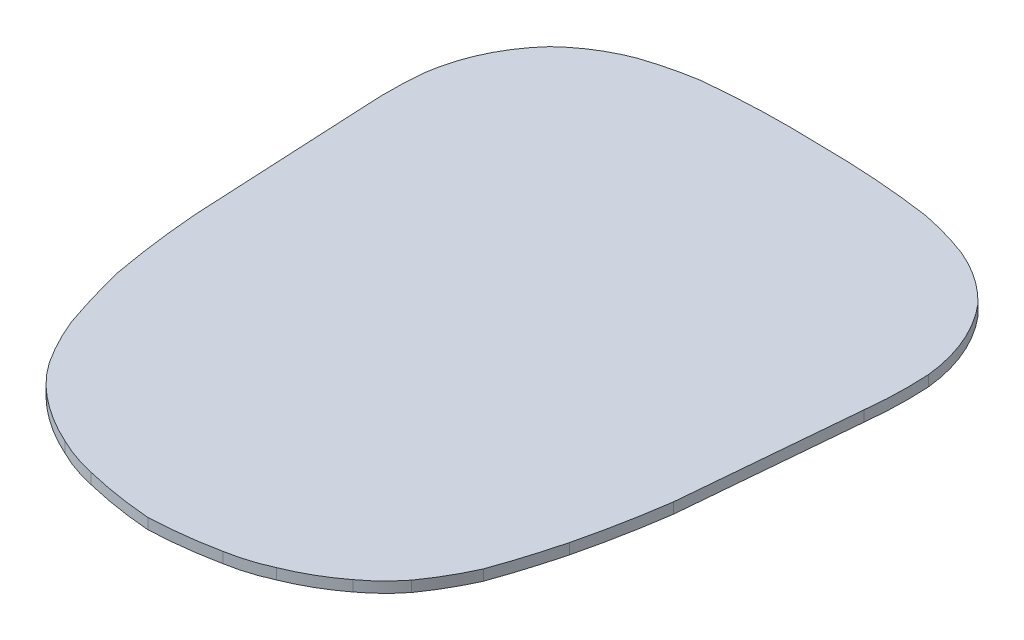
ISO-10303-21;
HEADER;
FILE_DESCRIPTION(('STEP AP214'),'2;1');
FILE_NAME('part.step','',(''),(''),'','','');
FILE_SCHEMA(('AUTOMOTIVE_DESIGN { 1 0 10303 214 1 1 1 1 }'));
ENDSEC;
DATA;
#1=APPLICATION_CONTEXT('core data for automotive mechanical design processes');
#2=APPLICATION_PROTOCOL_DEFINITION('international standard','automotive_design',2000,#1);
#3=PRODUCT_CONTEXT('',#1,'mechanical');
#4=PRODUCT('Part','Part','',(#3));
#5=PRODUCT_RELATED_PRODUCT_CATEGORY('part','',(#4));
#6=PRODUCT_DEFINITION_FORMATION('','',#4);
#7=PRODUCT_DEFINITION_CONTEXT('part definition',#1,'design');
#8=PRODUCT_DEFINITION('design','',#6,#7);
#9=PRODUCT_DEFINITION_SHAPE('','',#8);
#10=(LENGTH_UNIT() NAMED_UNIT(*) SI_UNIT(.MILLI.,.METRE.));
#11=(NAMED_UNIT(*) PLANE_ANGLE_UNIT() SI_UNIT($,.RADIAN.));
#12=(NAMED_UNIT(*) SI_UNIT($,.STERADIAN.) SOLID_ANGLE_UNIT());
#13=UNCERTAINTY_MEASURE_WITH_UNIT(LENGTH_MEASURE(1.E-05),#10,'distance_accuracy_value','');
#14=(GEOMETRIC_REPRESENTATION_CONTEXT(3) GLOBAL_UNCERTAINTY_ASSIGNED_CONTEXT((#13)) GLOBAL_UNIT_ASSIGNED_CONTEXT((#10,
#11,#12)) REPRESENTATION_CONTEXT('',''));
#15=CARTESIAN_POINT('',(0.,0.,0.));
#16=DIRECTION('',(0.,0.,1.));
#17=DIRECTION('',(1.,0.,0.));
#18=AXIS2_PLACEMENT_3D('',#15,#16,#17);
#19=CARTESIAN_POINT('',(-1.57240860866984,5.16860732929248,56.7680888848849));
#20=DIRECTION('',(0.,1.,0.));
#21=DIRECTION('',(1.,0.,0.));
#22=AXIS2_PLACEMENT_3D('',#19,#20,#21);
#23=PLANE('',#22);
#24=CARTESIAN_POINT('',(4.42207857906224,5.16860732929223,26.1060065080088));
#25=DIRECTION('',(0.,-1.,0.));
#26=DIRECTION('',(-1.,0.,0.));
#27=AXIS2_PLACEMENT_3D('',#24,#25,#26);
#28=CIRCLE('',#27,7.3740595978);
#29=CARTESIAN_POINT('',(11.7593440485897,5.16860732929245,25.370282115599));
#30=VERTEX_POINT('',#29);
#31=CARTESIAN_POINT('',(10.0538039694728,5.16860732929234,21.3457098703073));
#32=VERTEX_POINT('',#31);
#33=EDGE_CURVE('E301',#30,#32,#28,.F.);
#34=ORIENTED_EDGE('',*,*,#33,.F.);
#35=CARTESIAN_POINT('',(-5.02148164229063,5.16860732929193,26.3930993028761));
#36=DIRECTION('',(0.,-1.,0.));
#37=DIRECTION('',(-1.,0.,0.));
#38=AXIS2_PLACEMENT_3D('',#35,#36,#37);
#39=CIRCLE('',#38,16.81196793556);
#40=CARTESIAN_POINT('',(11.6806465076376,5.16860732929249,28.3117397407053));
#41=VERTEX_POINT('',#40);
#42=EDGE_CURVE('E304',#41,#30,#39,.F.);
#43=ORIENTED_EDGE('',*,*,#42,.F.);
#44=DIRECTION('',(-0.0886995040357044,0.,0.996058431008854));
#45=VECTOR('',#44,1.);
#46=CARTESIAN_POINT('',(11.6806465076376,5.1686073292925,28.3117397407053));
#47=LINE('',#46,#45);
#48=CARTESIAN_POINT('',(10.9521530708851,5.16860732929253,36.4924171582455));
#49=VERTEX_POINT('',#48);
#50=EDGE_CURVE('E195',#41,#49,#47,.T.);
#51=ORIENTED_EDGE('',*,*,#50,.T.);
#52=CARTESIAN_POINT('',(-29.9774053404907,5.1686073292912,30.7359674961748));
#53=DIRECTION('',(0.,-1.,0.));
#54=DIRECTION('',(-1.,0.,0.));
#55=AXIS2_PLACEMENT_3D('',#52,#53,#54);
#56=CIRCLE('',#55,41.33237791928);
#57=CARTESIAN_POINT('',(10.168074425755,5.16860732929263,40.5698842540155));
#58=VERTEX_POINT('',#57);
#59=EDGE_CURVE('E20',#58,#49,#56,.F.);
#60=ORIENTED_EDGE('',*,*,#59,.F.);
#61=CARTESIAN_POINT('',(-23.6697185475927,5.16860732929142,31.8539569853536));
#62=DIRECTION('',(0.,-1.,0.));
#63=DIRECTION('',(-1.,0.,0.));
#64=AXIS2_PLACEMENT_3D('',#61,#62,#63);
#65=CIRCLE('',#64,34.94228987144);
#66=CARTESIAN_POINT('',(9.22351885768019,5.16860732929264,43.6437218031986));
#67=VERTEX_POINT('',#66);
#68=EDGE_CURVE('E193',#67,#58,#65,.F.);
#69=ORIENTED_EDGE('',*,*,#68,.F.);
#70=CARTESIAN_POINT('',(-2.27662830007267,5.1686073292922,38.4722908655235));
#71=DIRECTION('',(0.,-1.,0.));
#72=DIRECTION('',(-1.,0.,0.));
#73=AXIS2_PLACEMENT_3D('',#70,#71,#72);
#74=CIRCLE('',#73,12.60940452968);
#75=CARTESIAN_POINT('',(8.0018089067518,5.16860732929262,45.7764548271608));
#76=VERTEX_POINT('',#75);
#77=EDGE_CURVE('E206',#76,#67,#74,.F.);
#78=ORIENTED_EDGE('',*,*,#77,.F.);
#79=CARTESIAN_POINT('',(2.40671094314175,5.16860732929238,41.4066557836026));
#80=DIRECTION('',(0.,-1.,0.));
#81=DIRECTION('',(-1.,0.,0.));
#82=AXIS2_PLACEMENT_3D('',#79,#80,#81);
#83=CIRCLE('',#82,7.09931439672);
#84=CARTESIAN_POINT('',(6.60488205735892,5.1686073292926,47.1316557136662));
#85=VERTEX_POINT('',#84);
#86=EDGE_CURVE('E224',#85,#76,#83,.F.);
#87=ORIENTED_EDGE('',*,*,#86,.F.);
#88=CARTESIAN_POINT('',(0.665319016808511,5.1686073292923,39.3768483498174));
#89=DIRECTION('',(0.,-1.,0.));
#90=DIRECTION('',(-1.,0.,0.));
#91=AXIS2_PLACEMENT_3D('',#88,#89,#90);
#92=CIRCLE('',#91,9.76808304444);
#93=CARTESIAN_POINT('',(4.32729672971718,5.16860732929254,48.4325297484331));
#94=VERTEX_POINT('',#93);
#95=EDGE_CURVE('E228',#94,#85,#92,.F.);
#96=ORIENTED_EDGE('',*,*,#95,.F.);
#97=CARTESIAN_POINT('',(1.09627151620222,5.16860732929234,41.3746398254039));
#98=DIRECTION('',(0.,-1.,0.));
#99=DIRECTION('',(-1.,0.,0.));
#100=AXIS2_PLACEMENT_3D('',#97,#98,#99);
#101=CIRCLE('',#100,7.76230211316);
#102=CARTESIAN_POINT('',(2.42169589731142,5.1686073292925,49.0229458016269));
#103=VERTEX_POINT('',#102);
#104=EDGE_CURVE('E232',#103,#94,#101,.F.);
#105=ORIENTED_EDGE('',*,*,#104,.F.);
#106=CARTESIAN_POINT('',(-1.50562705310554,5.16860732929211,29.7823019466603));
#107=DIRECTION('',(0.,-1.,0.));
#108=DIRECTION('',(-1.,0.,0.));
#109=AXIS2_PLACEMENT_3D('',#106,#107,#108);
#110=CIRCLE('',#109,19.6373684976);
#111=CARTESIAN_POINT('',(-0.711226246908728,5.16860732929241,49.4035957080219));
#112=VERTEX_POINT('',#111);
#113=EDGE_CURVE('E236',#112,#103,#110,.F.);
#114=ORIENTED_EDGE('',*,*,#113,.F.);
#115=CARTESIAN_POINT('',(0.780834496719782,5.16860732929217,29.8233057086877));
#116=DIRECTION('',(0.,-1.,0.));
#117=DIRECTION('',(-1.,0.,0.));
#118=AXIS2_PLACEMENT_3D('',#115,#116,#117);
#119=CIRCLE('',#118,19.63705684976);
#120=CARTESIAN_POINT('',(-3.87229574569524,5.16860732929229,48.9011038171652));
#121=VERTEX_POINT('',#120);
#122=EDGE_CURVE('E240',#121,#112,#119,.F.);
#123=ORIENTED_EDGE('',*,*,#122,.F.);
#124=CARTESIAN_POINT('',(-2.25185647870516,5.16860732929224,41.3098252240714));
#125=DIRECTION('',(0.,-1.,0.));
#126=DIRECTION('',(-1.,0.,0.));
#127=AXIS2_PLACEMENT_3D('',#124,#125,#126);
#128=CIRCLE('',#127,7.76230211316);
#129=CARTESIAN_POINT('',(-5.75361833776045,5.16860732929222,48.2373787589373));
#130=VERTEX_POINT('',#129);
#131=EDGE_CURVE('E244',#130,#121,#128,.F.);
#132=ORIENTED_EDGE('',*,*,#131,.F.);
#133=CARTESIAN_POINT('',(-1.74390750050734,5.16860732929222,39.3302094350337));
#134=DIRECTION('',(0.,-1.,0.));
#135=DIRECTION('',(-1.,0.,0.));
#136=AXIS2_PLACEMENT_3D('',#133,#134,#135);
#137=CIRCLE('',#136,9.76808304444);
#138=CARTESIAN_POINT('',(-7.97915028682781,5.16860732929213,46.8493313092098));
#139=VERTEX_POINT('',#138);
#140=EDGE_CURVE('E248',#139,#130,#137,.F.);
#141=ORIENTED_EDGE('',*,*,#140,.F.);
#142=CARTESIAN_POINT('',(-3.45763258069554,5.1686073292922,41.3761108188031));
#143=DIRECTION('',(0.,-1.,0.));
#144=DIRECTION('',(-1.,0.,0.));
#145=AXIS2_PLACEMENT_3D('',#142,#143,#144);
#146=CIRCLE('',#145,7.09931439672);
#147=CARTESIAN_POINT('',(-9.27735431255502,5.16860732929207,45.4419568398912));
#148=VERTEX_POINT('',#147);
#149=EDGE_CURVE('E252',#148,#139,#146,.F.);
#150=ORIENTED_EDGE('',*,*,#149,.F.);
#151=CARTESIAN_POINT('',(1.27607088396148,5.16860732929231,38.5410656500053));
#152=DIRECTION('',(0.,-1.,0.));
#153=DIRECTION('',(-1.,0.,0.));
#154=AXIS2_PLACEMENT_3D('',#151,#152,#153);
#155=CIRCLE('',#154,12.60940452968);
#156=CARTESIAN_POINT('',(-10.4156070143636,5.168607329292,43.2635385736895));
#157=VERTEX_POINT('',#156);
#158=EDGE_CURVE('E256',#157,#148,#155,.F.);
#159=ORIENTED_EDGE('',*,*,#158,.F.);
#160=CARTESIAN_POINT('',(22.611452308667,5.1686073292929,31.8540261418302));
#161=DIRECTION('',(0.,-1.,0.));
#162=DIRECTION('',(-1.,0.,0.));
#163=AXIS2_PLACEMENT_3D('',#160,#161,#162);
#164=CIRCLE('',#163,34.94228987144);
#165=CARTESIAN_POINT('',(-11.3308378537233,5.16860732929195,40.1536984240254));
#166=VERTEX_POINT('',#165);
#167=EDGE_CURVE('E260',#166,#157,#164,.F.);
#168=ORIENTED_EDGE('',*,*,#167,.F.);
#169=CARTESIAN_POINT('',(29.3351155793447,5.16860732929312,32.7614257124887));
#170=DIRECTION('',(0.,-1.,0.));
#171=DIRECTION('',(-1.,0.,0.));
#172=AXIS2_PLACEMENT_3D('',#169,#170,#171);
#173=CIRCLE('',#172,41.33237791928);
#174=CARTESIAN_POINT('',(-11.8661733347099,5.16860732929185,36.0506895028805));
#175=VERTEX_POINT('',#174);
#176=EDGE_CURVE('E264',#175,#166,#173,.F.);
#177=ORIENTED_EDGE('',*,*,#176,.F.);
#178=DIRECTION('',(-0.0500831809567766,0.,-0.998745050042928));
#179=VECTOR('',#178,1.);
#180=CARTESIAN_POINT('',(-11.86617333471,5.16860732929186,36.0506895028802));
#181=LINE('',#180,#179);
#182=CARTESIAN_POINT('',(-12.2775089900256,5.16860732929179,27.8479467496356));
#183=VERTEX_POINT('',#182);
#184=EDGE_CURVE('E271',#175,#183,#181,.T.);
#185=ORIENTED_EDGE('',*,*,#184,.T.);
#186=CARTESIAN_POINT('',(4.48636162568613,5.16860732929224,26.5771565049552));
#187=DIRECTION('',(0.,-1.,0.));
#188=DIRECTION('',(-1.,0.,0.));
#189=AXIS2_PLACEMENT_3D('',#186,#187,#188);
#190=CIRCLE('',#189,16.81196793556);
#191=CARTESIAN_POINT('',(-12.2423060527562,5.16860732929168,24.9056471359907));
#192=VERTEX_POINT('',#191);
#193=EDGE_CURVE('E267',#192,#183,#190,.F.);
#194=ORIENTED_EDGE('',*,*,#193,.F.);
#195=CARTESIAN_POINT('',(-4.93901211459909,5.16860732929193,25.9247902097461));
#196=DIRECTION('',(0.,-1.,0.));
#197=DIRECTION('',(-1.,0.,0.));
#198=AXIS2_PLACEMENT_3D('',#195,#196,#197);
#199=CIRCLE('',#198,7.3740595978);
#200=CARTESIAN_POINT('',(-10.3822831278823,5.16860732929168,20.9500986989229));
#201=VERTEX_POINT('',#200);
#202=EDGE_CURVE('E273',#201,#192,#199,.F.);
#203=ORIENTED_EDGE('',*,*,#202,.F.);
#204=CARTESIAN_POINT('',(-5.24273193998357,5.16860732929193,26.3246247690594));
#205=DIRECTION('',(0.,-1.,0.));
#206=DIRECTION('',(-1.,0.,0.));
#207=AXIS2_PLACEMENT_3D('',#204,#205,#206);
#208=CIRCLE('',#207,7.43643173112);
#209=CARTESIAN_POINT('',(-7.86404338634427,5.16860732929174,19.3655125273445));
#210=VERTEX_POINT('',#209);
#211=EDGE_CURVE('E277',#210,#201,#208,.F.);
#212=ORIENTED_EDGE('',*,*,#211,.F.);
#213=CARTESIAN_POINT('',(-3.13266364538476,5.1686073292921,33.5130256945662));
#214=DIRECTION('',(0.,-1.,0.));
#215=DIRECTION('',(-1.,0.,0.));
#216=AXIS2_PLACEMENT_3D('',#213,#214,#215);
#217=CIRCLE('',#216,14.91771038296);
#218=CARTESIAN_POINT('',(-5.49599442515238,5.16860732929181,18.7837096651208));
#219=VERTEX_POINT('',#218);
#220=EDGE_CURVE('E281',#219,#210,#217,.F.);
#221=ORIENTED_EDGE('',*,*,#220,.F.);
#222=CARTESIAN_POINT('',(-1.57240860866984,5.16860732929248,56.7680888848849));
#223=DIRECTION('',(0.,-1.,0.));
#224=DIRECTION('',(-1.,0.,0.));
#225=AXIS2_PLACEMENT_3D('',#222,#223,#224);
#226=CIRCLE('',#225,38.18648439396);
#227=CARTESIAN_POINT('',(-0.115098477137755,5.16860732929197,18.6094222736066));
#228=VERTEX_POINT('',#227);
#229=EDGE_CURVE('E285',#228,#219,#226,.F.);
#230=ORIENTED_EDGE('',*,*,#229,.F.);
#231=CARTESIAN_POINT('',(-0.135712780641728,5.16860732929252,56.7959011448422));
#232=DIRECTION('',(0.,-1.,0.));
#233=DIRECTION('',(-1.,0.,0.));
#234=AXIS2_PLACEMENT_3D('',#231,#232,#233);
#235=CIRCLE('',#234,38.186484435371);
#236=CARTESIAN_POINT('',(5.25502065738692,5.16860732929216,18.9918327588477));
#237=VERTEX_POINT('',#236);
#238=EDGE_CURVE('E289',#237,#228,#235,.F.);
#239=ORIENTED_EDGE('',*,*,#238,.F.);
#240=CARTESIAN_POINT('',(2.32340041465548,5.16860732929227,33.6186466915632));
#241=DIRECTION('',(0.,-1.,0.));
#242=DIRECTION('',(-1.,0.,0.));
#243=AXIS2_PLACEMENT_3D('',#240,#241,#242);
#244=CIRCLE('',#243,14.91771038296);
#245=CARTESIAN_POINT('',(7.59877825453698,5.16860732929224,19.6648489391103));
#246=VERTEX_POINT('',#245);
#247=EDGE_CURVE('E293',#246,#237,#244,.F.);
#248=ORIENTED_EDGE('',*,*,#247,.F.);
#249=CARTESIAN_POINT('',(4.71009628830575,5.16860732929225,26.5172961946226));
#250=DIRECTION('',(0.,-1.,0.));
#251=DIRECTION('',(-1.,0.,0.));
#252=AXIS2_PLACEMENT_3D('',#249,#250,#251);
#253=CIRCLE('',#252,7.43643173111999);
#254=EDGE_CURVE('E297',#32,#246,#253,.F.);
#255=ORIENTED_EDGE('',*,*,#254,.F.);
#256=EDGE_LOOP('',(#34,#43,#51,#60,#69,#78,#87,#96,#105,#114,#123,#132,#141,#150,#159,#168,#177,
#185,#194,#203,#212,#221,#230,#239,#248,#255));
#257=FACE_BOUND('',#256,.T.);
#258=ADVANCED_FACE('F17',(#257),#23,.F.);
#259=CARTESIAN_POINT('',(-29.9774053404908,5.5496073292912,30.7359674961748));
#260=DIRECTION('',(0.,-1.,0.));
#261=DIRECTION('',(-1.,0.,0.));
#262=AXIS2_PLACEMENT_3D('',#259,#260,#261);
#263=CYLINDRICAL_SURFACE('',#262,41.33237791928);
#264=DIRECTION('',(0.,-1.,0.));
#265=VECTOR('',#264,1.);
#266=CARTESIAN_POINT('',(10.1680744257548,5.54960732929262,40.5698842540161));
#267=LINE('',#266,#265);
#268=CARTESIAN_POINT('',(10.1680744257549,5.66960732929264,40.5698842540157));
#269=VERTEX_POINT('',#268);
#270=EDGE_CURVE('E200',#58,#269,#267,.F.);
#271=ORIENTED_EDGE('',*,*,#270,.F.);
#272=ORIENTED_EDGE('',*,*,#59,.T.);
#273=DIRECTION('',(0.,1.,0.));
#274=VECTOR('',#273,1.);
#275=CARTESIAN_POINT('',(10.9521530708851,5.54960732929249,36.4924171582454));
#276=LINE('',#275,#274);
#277=CARTESIAN_POINT('',(10.9521530708851,5.66960732929259,36.4924171582455));
#278=VERTEX_POINT('',#277);
#279=EDGE_CURVE('E313',#49,#278,#276,.T.);
#280=ORIENTED_EDGE('',*,*,#279,.T.);
#281=CARTESIAN_POINT('',(-29.9774053404908,5.6696073292912,30.7359674961748));
#282=DIRECTION('',(0.,-1.,0.));
#283=DIRECTION('',(-1.,0.,0.));
#284=AXIS2_PLACEMENT_3D('',#281,#282,#283);
#285=CIRCLE('',#284,41.33237791928);
#286=EDGE_CURVE('E203',#269,#278,#285,.F.);
#287=ORIENTED_EDGE('',*,*,#286,.F.);
#288=EDGE_LOOP('',(#271,#272,#280,#287));
#289=FACE_BOUND('',#288,.T.);
#290=ADVANCED_FACE('F201',(#289),#263,.T.);
#291=CARTESIAN_POINT('',(11.6806465076376,5.54960732929249,28.3117397407053));
#292=DIRECTION('',(-0.996058431008854,0.,-0.0886995040357044));
#293=DIRECTION('',(-0.0886995040357044,0.,0.996058431008854));
#294=AXIS2_PLACEMENT_3D('',#291,#292,#293);
#295=PLANE('',#294);
#296=ORIENTED_EDGE('',*,*,#50,.F.);
#297=DIRECTION('',(0.,-1.,0.));
#298=VECTOR('',#297,1.);
#299=CARTESIAN_POINT('',(11.6806465076376,5.54960732929249,28.3117397407052));
#300=LINE('',#299,#298);
#301=CARTESIAN_POINT('',(11.6806465076376,5.6696073292925,28.3117397407053));
#302=VERTEX_POINT('',#301);
#303=EDGE_CURVE('E306',#302,#41,#300,.T.);
#304=ORIENTED_EDGE('',*,*,#303,.F.);
#305=DIRECTION('',(0.088699504035705,0.,-0.996058431008854));
#306=VECTOR('',#305,1.);
#307=CARTESIAN_POINT('',(10.9521530708851,5.6696073292926,36.4924171582454));
#308=LINE('',#307,#306);
#309=EDGE_CURVE('E215',#278,#302,#308,.T.);
#310=ORIENTED_EDGE('',*,*,#309,.F.);
#311=ORIENTED_EDGE('',*,*,#279,.F.);
#312=EDGE_LOOP('',(#296,#304,#310,#311));
#313=FACE_BOUND('',#312,.T.);
#314=ADVANCED_FACE('F583',(#313),#295,.F.);
#315=CARTESIAN_POINT('',(-5.02148164229064,5.54960732929193,26.3930993028761));
#316=DIRECTION('',(0.,-1.,0.));
#317=DIRECTION('',(-1.,0.,0.));
#318=AXIS2_PLACEMENT_3D('',#315,#316,#317);
#319=CYLINDRICAL_SURFACE('',#318,16.81196793556);
#320=ORIENTED_EDGE('',*,*,#303,.T.);
#321=ORIENTED_EDGE('',*,*,#42,.T.);
#322=DIRECTION('',(0.,-1.,0.));
#323=VECTOR('',#322,1.);
#324=CARTESIAN_POINT('',(11.7593440485897,5.54960732929245,25.3702821155991));
#325=LINE('',#324,#323);
#326=CARTESIAN_POINT('',(11.7593440485897,5.66960732929246,25.3702821155991));
#327=VERTEX_POINT('',#326);
#328=EDGE_CURVE('E303',#327,#30,#325,.T.);
#329=ORIENTED_EDGE('',*,*,#328,.F.);
#330=CARTESIAN_POINT('',(-5.02148164229065,5.66960732929193,26.3930993028761));
#331=DIRECTION('',(0.,-1.,0.));
#332=DIRECTION('',(-1.,0.,0.));
#333=AXIS2_PLACEMENT_3D('',#330,#331,#332);
#334=CIRCLE('',#333,16.81196793556);
#335=EDGE_CURVE('E407',#302,#327,#334,.F.);
#336=ORIENTED_EDGE('',*,*,#335,.F.);
#337=EDGE_LOOP('',(#320,#321,#329,#336));
#338=FACE_BOUND('',#337,.T.);
#339=ADVANCED_FACE('F580',(#338),#319,.T.);
#340=CARTESIAN_POINT('',(4.42207857906223,5.54960732929223,26.1060065080088));
#341=DIRECTION('',(0.,-1.,0.));
#342=DIRECTION('',(-1.,0.,0.));
#343=AXIS2_PLACEMENT_3D('',#340,#341,#342);
#344=CYLINDRICAL_SURFACE('',#343,7.3740595978);
#345=ORIENTED_EDGE('',*,*,#328,.T.);
#346=ORIENTED_EDGE('',*,*,#33,.T.);
#347=DIRECTION('',(0.,-1.,0.));
#348=VECTOR('',#347,1.);
#349=CARTESIAN_POINT('',(10.0538039694727,5.54960732929234,21.3457098703073));
#350=LINE('',#349,#348);
#351=CARTESIAN_POINT('',(10.0538039694727,5.66960732929234,21.3457098703073));
#352=VERTEX_POINT('',#351);
#353=EDGE_CURVE('E300',#352,#32,#350,.T.);
#354=ORIENTED_EDGE('',*,*,#353,.F.);
#355=CARTESIAN_POINT('',(4.42207857906222,5.66960732929223,26.1060065080088));
#356=DIRECTION('',(0.,-1.,0.));
#357=DIRECTION('',(-1.,0.,0.));
#358=AXIS2_PLACEMENT_3D('',#355,#356,#357);
#359=CIRCLE('',#358,7.3740595978);
#360=EDGE_CURVE('E404',#327,#352,#359,.F.);
#361=ORIENTED_EDGE('',*,*,#360,.F.);
#362=EDGE_LOOP('',(#345,#346,#354,#361));
#363=FACE_BOUND('',#362,.T.);
#364=ADVANCED_FACE('F484',(#363),#344,.T.);
#365=CARTESIAN_POINT('',(4.71009628830574,5.54960732929224,26.5172961946226));
#366=DIRECTION('',(0.,-1.,0.));
#367=DIRECTION('',(-1.,0.,0.));
#368=AXIS2_PLACEMENT_3D('',#365,#366,#367);
#369=CYLINDRICAL_SURFACE('',#368,7.43643173111999);
#370=ORIENTED_EDGE('',*,*,#353,.T.);
#371=ORIENTED_EDGE('',*,*,#254,.T.);
#372=DIRECTION('',(0.,-1.,0.));
#373=VECTOR('',#372,1.);
#374=CARTESIAN_POINT('',(7.598778254537,5.54960732929224,19.6648489391103));
#375=LINE('',#374,#373);
#376=CARTESIAN_POINT('',(7.59877825453697,5.66960732929225,19.6648489391103));
#377=VERTEX_POINT('',#376);
#378=EDGE_CURVE('E296',#377,#246,#375,.T.);
#379=ORIENTED_EDGE('',*,*,#378,.F.);
#380=CARTESIAN_POINT('',(4.71009628830574,5.66960732929225,26.5172961946226));
#381=DIRECTION('',(0.,-1.,0.));
#382=DIRECTION('',(-1.,0.,0.));
#383=AXIS2_PLACEMENT_3D('',#380,#381,#382);
#384=CIRCLE('',#383,7.43643173111999);
#385=EDGE_CURVE('E400',#352,#377,#384,.F.);
#386=ORIENTED_EDGE('',*,*,#385,.F.);
#387=EDGE_LOOP('',(#370,#371,#379,#386));
#388=FACE_BOUND('',#387,.T.);
#389=ADVANCED_FACE('F479',(#388),#369,.T.);
#390=CARTESIAN_POINT('',(2.32340041465546,5.54960732929227,33.6186466915632));
#391=DIRECTION('',(0.,-1.,0.));
#392=DIRECTION('',(-1.,0.,0.));
#393=AXIS2_PLACEMENT_3D('',#390,#391,#392);
#394=CYLINDRICAL_SURFACE('',#393,14.91771038296);
#395=ORIENTED_EDGE('',*,*,#378,.T.);
#396=ORIENTED_EDGE('',*,*,#247,.T.);
#397=DIRECTION('',(0.,-1.,0.));
#398=VECTOR('',#397,1.);
#399=CARTESIAN_POINT('',(5.25502065738693,5.54960732929216,18.9918327588477));
#400=LINE('',#399,#398);
#401=CARTESIAN_POINT('',(5.25502065738692,5.66960732929216,18.9918327588477));
#402=VERTEX_POINT('',#401);
#403=EDGE_CURVE('E292',#402,#237,#400,.T.);
#404=ORIENTED_EDGE('',*,*,#403,.F.);
#405=CARTESIAN_POINT('',(2.32340041465546,5.66960732929227,33.6186466915632));
#406=DIRECTION('',(0.,-1.,0.));
#407=DIRECTION('',(-1.,0.,0.));
#408=AXIS2_PLACEMENT_3D('',#405,#406,#407);
#409=CIRCLE('',#408,14.91771038296);
#410=EDGE_CURVE('E396',#377,#402,#409,.F.);
#411=ORIENTED_EDGE('',*,*,#410,.F.);
#412=EDGE_LOOP('',(#395,#396,#404,#411));
#413=FACE_BOUND('',#412,.T.);
#414=ADVANCED_FACE('F489',(#413),#394,.T.);
#415=CARTESIAN_POINT('',(-0.13571278064174,5.54960732929253,56.7959011448422));
#416=DIRECTION('',(0.,-1.,0.));
#417=DIRECTION('',(-1.,0.,0.));
#418=AXIS2_PLACEMENT_3D('',#415,#416,#417);
#419=CYLINDRICAL_SURFACE('',#418,38.186484435371);
#420=ORIENTED_EDGE('',*,*,#403,.T.);
#421=ORIENTED_EDGE('',*,*,#238,.T.);
#422=DIRECTION('',(0.,-1.,0.));
#423=VECTOR('',#422,1.);
#424=CARTESIAN_POINT('',(-0.115098477137782,5.54960732929198,18.6094222736066));
#425=LINE('',#424,#423);
#426=CARTESIAN_POINT('',(-0.115098477137771,5.66960732929198,18.6094222736066));
#427=VERTEX_POINT('',#426);
#428=EDGE_CURVE('E288',#427,#228,#425,.T.);
#429=ORIENTED_EDGE('',*,*,#428,.F.);
#430=CARTESIAN_POINT('',(-0.135712780641744,5.66960732929253,56.7959011448422));
#431=DIRECTION('',(0.,-1.,0.));
#432=DIRECTION('',(-1.,0.,0.));
#433=AXIS2_PLACEMENT_3D('',#430,#431,#432);
#434=CIRCLE('',#433,38.186484435371);
#435=EDGE_CURVE('E392',#402,#427,#434,.F.);
#436=ORIENTED_EDGE('',*,*,#435,.F.);
#437=EDGE_LOOP('',(#420,#421,#429,#436));
#438=FACE_BOUND('',#437,.T.);
#439=ADVANCED_FACE('F569',(#438),#419,.T.);
#440=CARTESIAN_POINT('',(-1.57240860866986,5.54960732929248,56.7680888848849));
#441=DIRECTION('',(0.,-1.,0.));
#442=DIRECTION('',(-1.,0.,0.));
#443=AXIS2_PLACEMENT_3D('',#440,#441,#442);
#444=CYLINDRICAL_SURFACE('',#443,38.18648439396);
#445=ORIENTED_EDGE('',*,*,#428,.T.);
#446=ORIENTED_EDGE('',*,*,#229,.T.);
#447=DIRECTION('',(0.,-1.,0.));
#448=VECTOR('',#447,1.);
#449=CARTESIAN_POINT('',(-5.4959944251524,5.54960732929181,18.7837096651208));
#450=LINE('',#449,#448);
#451=CARTESIAN_POINT('',(-5.49599442515242,5.66960732929181,18.7837096651208));
#452=VERTEX_POINT('',#451);
#453=EDGE_CURVE('E284',#452,#219,#450,.T.);
#454=ORIENTED_EDGE('',*,*,#453,.F.);
#455=CARTESIAN_POINT('',(-1.57240860866986,5.66960732929248,56.7680888848849));
#456=DIRECTION('',(0.,-1.,0.));
#457=DIRECTION('',(-1.,0.,0.));
#458=AXIS2_PLACEMENT_3D('',#455,#456,#457);
#459=CIRCLE('',#458,38.18648439396);
#460=EDGE_CURVE('E388',#427,#452,#459,.F.);
#461=ORIENTED_EDGE('',*,*,#460,.F.);
#462=EDGE_LOOP('',(#445,#446,#454,#461));
#463=FACE_BOUND('',#462,.T.);
#464=ADVANCED_FACE('F565',(#463),#444,.T.);
#465=CARTESIAN_POINT('',(-3.13266364538477,5.5496073292921,33.5130256945662));
#466=DIRECTION('',(0.,-1.,0.));
#467=DIRECTION('',(-1.,0.,0.));
#468=AXIS2_PLACEMENT_3D('',#465,#466,#467);
#469=CYLINDRICAL_SURFACE('',#468,14.91771038296);
#470=ORIENTED_EDGE('',*,*,#453,.T.);
#471=ORIENTED_EDGE('',*,*,#220,.T.);
#472=DIRECTION('',(0.,-1.,0.));
#473=VECTOR('',#472,1.);
#474=CARTESIAN_POINT('',(-7.86404338634426,5.54960732929175,19.3655125273444));
#475=LINE('',#474,#473);
#476=CARTESIAN_POINT('',(-7.86404338634429,5.66960732929175,19.3655125273444));
#477=VERTEX_POINT('',#476);
#478=EDGE_CURVE('E280',#477,#210,#475,.T.);
#479=ORIENTED_EDGE('',*,*,#478,.F.);
#480=CARTESIAN_POINT('',(-3.13266364538477,5.66960732929209,33.5130256945662));
#481=DIRECTION('',(0.,-1.,0.));
#482=DIRECTION('',(-1.,0.,0.));
#483=AXIS2_PLACEMENT_3D('',#480,#481,#482);
#484=CIRCLE('',#483,14.91771038296);
#485=EDGE_CURVE('E384',#452,#477,#484,.F.);
#486=ORIENTED_EDGE('',*,*,#485,.F.);
#487=EDGE_LOOP('',(#470,#471,#479,#486));
#488=FACE_BOUND('',#487,.T.);
#489=ADVANCED_FACE('F561',(#488),#469,.T.);
#490=CARTESIAN_POINT('',(-5.24273193998358,5.54960732929193,26.3246247690594));
#491=DIRECTION('',(0.,-1.,0.));
#492=DIRECTION('',(-1.,0.,0.));
#493=AXIS2_PLACEMENT_3D('',#490,#491,#492);
#494=CYLINDRICAL_SURFACE('',#493,7.43643173112);
#495=ORIENTED_EDGE('',*,*,#478,.T.);
#496=ORIENTED_EDGE('',*,*,#211,.T.);
#497=DIRECTION('',(0.,-1.,0.));
#498=VECTOR('',#497,1.);
#499=CARTESIAN_POINT('',(-10.3822831278823,5.54960732929169,20.9500986989229));
#500=LINE('',#499,#498);
#501=CARTESIAN_POINT('',(-10.3822831278823,5.6696073292917,20.9500986989229));
#502=VERTEX_POINT('',#501);
#503=EDGE_CURVE('E276',#502,#201,#500,.T.);
#504=ORIENTED_EDGE('',*,*,#503,.F.);
#505=CARTESIAN_POINT('',(-5.24273193998358,5.66960732929193,26.3246247690594));
#506=DIRECTION('',(0.,-1.,0.));
#507=DIRECTION('',(-1.,0.,0.));
#508=AXIS2_PLACEMENT_3D('',#505,#506,#507);
#509=CIRCLE('',#508,7.43643173112);
#510=EDGE_CURVE('E380',#477,#502,#509,.F.);
#511=ORIENTED_EDGE('',*,*,#510,.F.);
#512=EDGE_LOOP('',(#495,#496,#504,#511));
#513=FACE_BOUND('',#512,.T.);
#514=ADVANCED_FACE('F557',(#513),#494,.T.);
#515=CARTESIAN_POINT('',(-4.93901211459911,5.54960732929193,25.9247902097461));
#516=DIRECTION('',(0.,-1.,0.));
#517=DIRECTION('',(-1.,0.,0.));
#518=AXIS2_PLACEMENT_3D('',#515,#516,#517);
#519=CYLINDRICAL_SURFACE('',#518,7.3740595978);
#520=ORIENTED_EDGE('',*,*,#503,.T.);
#521=ORIENTED_EDGE('',*,*,#202,.T.);
#522=DIRECTION('',(0.,-1.,0.));
#523=VECTOR('',#522,1.);
#524=CARTESIAN_POINT('',(-12.2423060527562,5.54960732929168,24.9056471359907));
#525=LINE('',#524,#523);
#526=CARTESIAN_POINT('',(-12.2423060527562,5.6696073292917,24.9056471359907));
#527=VERTEX_POINT('',#526);
#528=EDGE_CURVE('E272',#527,#192,#525,.T.);
#529=ORIENTED_EDGE('',*,*,#528,.F.);
#530=CARTESIAN_POINT('',(-4.93901211459911,5.66960732929194,25.9247902097461));
#531=DIRECTION('',(0.,-1.,0.));
#532=DIRECTION('',(-1.,0.,0.));
#533=AXIS2_PLACEMENT_3D('',#530,#531,#532);
#534=CIRCLE('',#533,7.3740595978);
#535=EDGE_CURVE('E377',#502,#527,#534,.F.);
#536=ORIENTED_EDGE('',*,*,#535,.F.);
#537=EDGE_LOOP('',(#520,#521,#529,#536));
#538=FACE_BOUND('',#537,.T.);
#539=ADVANCED_FACE('F553',(#538),#519,.T.);
#540=CARTESIAN_POINT('',(4.48636162568612,5.54960732929224,26.5771565049552));
#541=DIRECTION('',(0.,-1.,0.));
#542=DIRECTION('',(-1.,0.,0.));
#543=AXIS2_PLACEMENT_3D('',#540,#541,#542);
#544=CYLINDRICAL_SURFACE('',#543,16.81196793556);
#545=ORIENTED_EDGE('',*,*,#528,.T.);
#546=ORIENTED_EDGE('',*,*,#193,.T.);
#547=DIRECTION('',(0.,1.,0.));
#548=VECTOR('',#547,1.);
#549=CARTESIAN_POINT('',(-12.2775089900256,5.54960732929186,27.8479467496357));
#550=LINE('',#549,#548);
#551=CARTESIAN_POINT('',(-12.2775089900256,5.66960732929173,27.8479467496357));
#552=VERTEX_POINT('',#551);
#553=EDGE_CURVE('E323',#183,#552,#550,.T.);
#554=ORIENTED_EDGE('',*,*,#553,.T.);
#555=CARTESIAN_POINT('',(4.48636162568611,5.66960732929224,26.5771565049552));
#556=DIRECTION('',(0.,-1.,0.));
#557=DIRECTION('',(-1.,0.,0.));
#558=AXIS2_PLACEMENT_3D('',#555,#556,#557);
#559=CIRCLE('',#558,16.81196793556);
#560=EDGE_CURVE('E373',#527,#552,#559,.F.);
#561=ORIENTED_EDGE('',*,*,#560,.F.);
#562=EDGE_LOOP('',(#545,#546,#554,#561));
#563=FACE_BOUND('',#562,.T.);
#564=ADVANCED_FACE('F549',(#563),#544,.T.);
#565=CARTESIAN_POINT('',(-11.86617333471,5.54960732929186,36.0506895028802));
#566=DIRECTION('',(0.998745050042928,0.,-0.0500831809567766));
#567=DIRECTION('',(-0.0500831809567766,0.,-0.998745050042928));
#568=AXIS2_PLACEMENT_3D('',#565,#566,#567);
#569=PLANE('',#568);
#570=ORIENTED_EDGE('',*,*,#184,.F.);
#571=DIRECTION('',(0.,-1.,0.));
#572=VECTOR('',#571,1.);
#573=CARTESIAN_POINT('',(-11.86617333471,5.54960732929186,36.0506895028805));
#574=LINE('',#573,#572);
#575=CARTESIAN_POINT('',(-11.86617333471,5.66960732929186,36.0506895028805));
#576=VERTEX_POINT('',#575);
#577=EDGE_CURVE('E266',#576,#175,#574,.T.);
#578=ORIENTED_EDGE('',*,*,#577,.F.);
#579=DIRECTION('',(0.0500831809567763,0.,0.998745050042928));
#580=VECTOR('',#579,1.);
#581=CARTESIAN_POINT('',(-12.2775089900256,5.66960732929173,27.8479467496356));
#582=LINE('',#581,#580);
#583=EDGE_CURVE('E372',#552,#576,#582,.T.);
#584=ORIENTED_EDGE('',*,*,#583,.F.);
#585=ORIENTED_EDGE('',*,*,#553,.F.);
#586=EDGE_LOOP('',(#570,#578,#584,#585));
#587=FACE_BOUND('',#586,.T.);
#588=ADVANCED_FACE('F545',(#587),#569,.F.);
#589=CARTESIAN_POINT('',(29.3351155793447,5.54960732929312,32.7614257124887));
#590=DIRECTION('',(0.,-1.,0.));
#591=DIRECTION('',(-1.,0.,0.));
#592=AXIS2_PLACEMENT_3D('',#589,#590,#591);
#593=CYLINDRICAL_SURFACE('',#592,41.33237791928);
#594=ORIENTED_EDGE('',*,*,#577,.T.);
#595=ORIENTED_EDGE('',*,*,#176,.T.);
#596=DIRECTION('',(0.,-1.,0.));
#597=VECTOR('',#596,1.);
#598=CARTESIAN_POINT('',(-11.3308378537233,5.54960732929193,40.1536984240256));
#599=LINE('',#598,#597);
#600=CARTESIAN_POINT('',(-11.3308378537233,5.66960732929194,40.1536984240254));
#601=VERTEX_POINT('',#600);
#602=EDGE_CURVE('E263',#601,#166,#599,.T.);
#603=ORIENTED_EDGE('',*,*,#602,.F.);
#604=CARTESIAN_POINT('',(29.3351155793447,5.66960732929311,32.7614257124887));
#605=DIRECTION('',(0.,-1.,0.));
#606=DIRECTION('',(-1.,0.,0.));
#607=AXIS2_PLACEMENT_3D('',#604,#605,#606);
#608=CIRCLE('',#607,41.33237791928);
#609=EDGE_CURVE('E368',#576,#601,#608,.F.);
#610=ORIENTED_EDGE('',*,*,#609,.F.);
#611=EDGE_LOOP('',(#594,#595,#603,#610));
#612=FACE_BOUND('',#611,.T.);
#613=ADVANCED_FACE('F541',(#612),#593,.T.);
#614=CARTESIAN_POINT('',(22.611452308667,5.54960732929289,31.8540261418302));
#615=DIRECTION('',(0.,-1.,0.));
#616=DIRECTION('',(-1.,0.,0.));
#617=AXIS2_PLACEMENT_3D('',#614,#615,#616);
#618=CYLINDRICAL_SURFACE('',#617,34.94228987144);
#619=ORIENTED_EDGE('',*,*,#602,.T.);
#620=ORIENTED_EDGE('',*,*,#167,.T.);
#621=DIRECTION('',(0.,-1.,0.));
#622=VECTOR('',#621,1.);
#623=CARTESIAN_POINT('',(-10.4156070143637,5.549607329292,43.2635385736895));
#624=LINE('',#623,#622);
#625=CARTESIAN_POINT('',(-10.4156070143636,5.669607329292,43.2635385736895));
#626=VERTEX_POINT('',#625);
#627=EDGE_CURVE('E259',#626,#157,#624,.T.);
#628=ORIENTED_EDGE('',*,*,#627,.F.);
#629=CARTESIAN_POINT('',(22.611452308667,5.66960732929289,31.8540261418302));
#630=DIRECTION('',(0.,-1.,0.));
#631=DIRECTION('',(-1.,0.,0.));
#632=AXIS2_PLACEMENT_3D('',#629,#630,#631);
#633=CIRCLE('',#632,34.94228987144);
#634=EDGE_CURVE('E364',#601,#626,#633,.F.);
#635=ORIENTED_EDGE('',*,*,#634,.F.);
#636=EDGE_LOOP('',(#619,#620,#628,#635));
#637=FACE_BOUND('',#636,.T.);
#638=ADVANCED_FACE('F537',(#637),#618,.T.);
#639=CARTESIAN_POINT('',(1.27607088396147,5.54960732929231,38.5410656500053));
#640=DIRECTION('',(0.,-1.,0.));
#641=DIRECTION('',(-1.,0.,0.));
#642=AXIS2_PLACEMENT_3D('',#639,#640,#641);
#643=CYLINDRICAL_SURFACE('',#642,12.60940452968);
#644=ORIENTED_EDGE('',*,*,#627,.T.);
#645=ORIENTED_EDGE('',*,*,#158,.T.);
#646=DIRECTION('',(0.,-1.,0.));
#647=VECTOR('',#646,1.);
#648=CARTESIAN_POINT('',(-9.27735431255505,5.54960732929207,45.4419568398912));
#649=LINE('',#648,#647);
#650=CARTESIAN_POINT('',(-9.27735431255505,5.66960732929207,45.4419568398912));
#651=VERTEX_POINT('',#650);
#652=EDGE_CURVE('E255',#651,#148,#649,.T.);
#653=ORIENTED_EDGE('',*,*,#652,.F.);
#654=CARTESIAN_POINT('',(1.27607088396146,5.66960732929231,38.5410656500053));
#655=DIRECTION('',(0.,-1.,0.));
#656=DIRECTION('',(-1.,0.,0.));
#657=AXIS2_PLACEMENT_3D('',#654,#655,#656);
#658=CIRCLE('',#657,12.60940452968);
#659=EDGE_CURVE('E360',#626,#651,#658,.F.);
#660=ORIENTED_EDGE('',*,*,#659,.F.);
#661=EDGE_LOOP('',(#644,#645,#653,#660));
#662=FACE_BOUND('',#661,.T.);
#663=ADVANCED_FACE('F533',(#662),#643,.T.);
#664=CARTESIAN_POINT('',(-3.45763258069556,5.5496073292922,41.376110818803));
#665=DIRECTION('',(0.,-1.,0.));
#666=DIRECTION('',(-1.,0.,0.));
#667=AXIS2_PLACEMENT_3D('',#664,#665,#666);
#668=CYLINDRICAL_SURFACE('',#667,7.09931439672);
#669=ORIENTED_EDGE('',*,*,#652,.T.);
#670=ORIENTED_EDGE('',*,*,#149,.T.);
#671=DIRECTION('',(0.,-1.,0.));
#672=VECTOR('',#671,1.);
#673=CARTESIAN_POINT('',(-7.97915028682789,5.54960732929213,46.8493313092098));
#674=LINE('',#673,#672);
#675=CARTESIAN_POINT('',(-7.9791502868279,5.66960732929213,46.8493313092098));
#676=VERTEX_POINT('',#675);
#677=EDGE_CURVE('E251',#676,#139,#674,.T.);
#678=ORIENTED_EDGE('',*,*,#677,.F.);
#679=CARTESIAN_POINT('',(-3.45763258069556,5.6696073292922,41.376110818803));
#680=DIRECTION('',(0.,-1.,0.));
#681=DIRECTION('',(-1.,0.,0.));
#682=AXIS2_PLACEMENT_3D('',#679,#680,#681);
#683=CIRCLE('',#682,7.09931439672);
#684=EDGE_CURVE('E356',#651,#676,#683,.F.);
#685=ORIENTED_EDGE('',*,*,#684,.F.);
#686=EDGE_LOOP('',(#669,#670,#678,#685));
#687=FACE_BOUND('',#686,.T.);
#688=ADVANCED_FACE('F529',(#687),#668,.T.);
#689=CARTESIAN_POINT('',(-1.74390750050735,5.54960732929222,39.3302094350337));
#690=DIRECTION('',(0.,-1.,0.));
#691=DIRECTION('',(-1.,0.,0.));
#692=AXIS2_PLACEMENT_3D('',#689,#690,#691);
#693=CYLINDRICAL_SURFACE('',#692,9.76808304444);
#694=ORIENTED_EDGE('',*,*,#677,.T.);
#695=ORIENTED_EDGE('',*,*,#140,.T.);
#696=DIRECTION('',(0.,-1.,0.));
#697=VECTOR('',#696,1.);
#698=CARTESIAN_POINT('',(-5.75361833776046,5.54960732929222,48.2373787589373));
#699=LINE('',#698,#697);
#700=CARTESIAN_POINT('',(-5.75361833776046,5.66960732929223,48.2373787589373));
#701=VERTEX_POINT('',#700);
#702=EDGE_CURVE('E247',#701,#130,#699,.T.);
#703=ORIENTED_EDGE('',*,*,#702,.F.);
#704=CARTESIAN_POINT('',(-1.74390750050736,5.66960732929223,39.3302094350337));
#705=DIRECTION('',(0.,-1.,0.));
#706=DIRECTION('',(-1.,0.,0.));
#707=AXIS2_PLACEMENT_3D('',#704,#705,#706);
#708=CIRCLE('',#707,9.76808304444);
#709=EDGE_CURVE('E352',#676,#701,#708,.F.);
#710=ORIENTED_EDGE('',*,*,#709,.F.);
#711=EDGE_LOOP('',(#694,#695,#703,#710));
#712=FACE_BOUND('',#711,.T.);
#713=ADVANCED_FACE('F525',(#712),#693,.T.);
#714=CARTESIAN_POINT('',(-2.25185647870517,5.54960732929224,41.3098252240714));
#715=DIRECTION('',(0.,-1.,0.));
#716=DIRECTION('',(-1.,0.,0.));
#717=AXIS2_PLACEMENT_3D('',#714,#715,#716);
#718=CYLINDRICAL_SURFACE('',#717,7.76230211316);
#719=ORIENTED_EDGE('',*,*,#702,.T.);
#720=ORIENTED_EDGE('',*,*,#131,.T.);
#721=DIRECTION('',(0.,-1.,0.));
#722=VECTOR('',#721,1.);
#723=CARTESIAN_POINT('',(-3.87229574569515,5.54960732929229,48.9011038171653));
#724=LINE('',#723,#722);
#725=CARTESIAN_POINT('',(-3.87229574569525,5.6696073292923,48.9011038171652));
#726=VERTEX_POINT('',#725);
#727=EDGE_CURVE('E243',#726,#121,#724,.T.);
#728=ORIENTED_EDGE('',*,*,#727,.F.);
#729=CARTESIAN_POINT('',(-2.25185647870518,5.66960732929224,41.3098252240713));
#730=DIRECTION('',(0.,-1.,0.));
#731=DIRECTION('',(-1.,0.,0.));
#732=AXIS2_PLACEMENT_3D('',#729,#730,#731);
#733=CIRCLE('',#732,7.76230211316);
#734=EDGE_CURVE('E348',#701,#726,#733,.F.);
#735=ORIENTED_EDGE('',*,*,#734,.F.);
#736=EDGE_LOOP('',(#719,#720,#728,#735));
#737=FACE_BOUND('',#736,.T.);
#738=ADVANCED_FACE('F521',(#737),#718,.T.);
#739=CARTESIAN_POINT('',(0.78083449671977,5.54960732929217,29.8233057086877));
#740=DIRECTION('',(0.,-1.,0.));
#741=DIRECTION('',(-1.,0.,0.));
#742=AXIS2_PLACEMENT_3D('',#739,#740,#741);
#743=CYLINDRICAL_SURFACE('',#742,19.63705684976);
#744=ORIENTED_EDGE('',*,*,#727,.T.);
#745=ORIENTED_EDGE('',*,*,#122,.T.);
#746=DIRECTION('',(0.,-1.,0.));
#747=VECTOR('',#746,1.);
#748=CARTESIAN_POINT('',(-0.711226246908729,5.5496073292924,49.4035957080219));
#749=LINE('',#748,#747);
#750=CARTESIAN_POINT('',(-0.711226246908744,5.6696073292924,49.4035957080219));
#751=VERTEX_POINT('',#750);
#752=EDGE_CURVE('E239',#751,#112,#749,.T.);
#753=ORIENTED_EDGE('',*,*,#752,.F.);
#754=CARTESIAN_POINT('',(0.780834496719766,5.66960732929216,29.8233057086877));
#755=DIRECTION('',(0.,-1.,0.));
#756=DIRECTION('',(-1.,0.,0.));
#757=AXIS2_PLACEMENT_3D('',#754,#755,#756);
#758=CIRCLE('',#757,19.63705684976);
#759=EDGE_CURVE('E344',#726,#751,#758,.F.);
#760=ORIENTED_EDGE('',*,*,#759,.F.);
#761=EDGE_LOOP('',(#744,#745,#753,#760));
#762=FACE_BOUND('',#761,.T.);
#763=ADVANCED_FACE('F517',(#762),#743,.T.);
#764=CARTESIAN_POINT('',(-1.50562705310556,5.54960732929209,29.7823019466603));
#765=DIRECTION('',(0.,-1.,0.));
#766=DIRECTION('',(-1.,0.,0.));
#767=AXIS2_PLACEMENT_3D('',#764,#765,#766);
#768=CYLINDRICAL_SURFACE('',#767,19.6373684976);
#769=ORIENTED_EDGE('',*,*,#752,.T.);
#770=ORIENTED_EDGE('',*,*,#113,.T.);
#771=DIRECTION('',(0.,-1.,0.));
#772=VECTOR('',#771,1.);
#773=CARTESIAN_POINT('',(2.42169589731143,5.5496073292925,49.0229458016269));
#774=LINE('',#773,#772);
#775=CARTESIAN_POINT('',(2.42169589731136,5.6696073292925,49.0229458016269));
#776=VERTEX_POINT('',#775);
#777=EDGE_CURVE('E235',#776,#103,#774,.T.);
#778=ORIENTED_EDGE('',*,*,#777,.F.);
#779=CARTESIAN_POINT('',(-1.50562705310556,5.66960732929209,29.7823019466603));
#780=DIRECTION('',(0.,-1.,0.));
#781=DIRECTION('',(-1.,0.,0.));
#782=AXIS2_PLACEMENT_3D('',#779,#780,#781);
#783=CIRCLE('',#782,19.6373684976);
#784=EDGE_CURVE('E340',#751,#776,#783,.F.);
#785=ORIENTED_EDGE('',*,*,#784,.F.);
#786=EDGE_LOOP('',(#769,#770,#778,#785));
#787=FACE_BOUND('',#786,.T.);
#788=ADVANCED_FACE('F513',(#787),#768,.T.);
#789=CARTESIAN_POINT('',(1.0962715162022,5.54960732929235,41.3746398254038));
#790=DIRECTION('',(0.,-1.,0.));
#791=DIRECTION('',(-1.,0.,0.));
#792=AXIS2_PLACEMENT_3D('',#789,#790,#791);
#793=CYLINDRICAL_SURFACE('',#792,7.76230211316);
#794=ORIENTED_EDGE('',*,*,#777,.T.);
#795=ORIENTED_EDGE('',*,*,#104,.T.);
#796=DIRECTION('',(0.,-1.,0.));
#797=VECTOR('',#796,1.);
#798=CARTESIAN_POINT('',(4.32729672971714,5.54960732929255,48.4325297484332));
#799=LINE('',#798,#797);
#800=CARTESIAN_POINT('',(4.32729672971716,5.66960732929257,48.4325297484331));
#801=VERTEX_POINT('',#800);
#802=EDGE_CURVE('E231',#801,#94,#799,.T.);
#803=ORIENTED_EDGE('',*,*,#802,.F.);
#804=CARTESIAN_POINT('',(1.0962715162022,5.66960732929235,41.3746398254038));
#805=DIRECTION('',(0.,-1.,0.));
#806=DIRECTION('',(-1.,0.,0.));
#807=AXIS2_PLACEMENT_3D('',#804,#805,#806);
#808=CIRCLE('',#807,7.76230211316);
#809=EDGE_CURVE('E336',#776,#801,#808,.F.);
#810=ORIENTED_EDGE('',*,*,#809,.F.);
#811=EDGE_LOOP('',(#794,#795,#803,#810));
#812=FACE_BOUND('',#811,.T.);
#813=ADVANCED_FACE('F509',(#812),#793,.T.);
#814=CARTESIAN_POINT('',(0.665319016808499,5.5496073292923,39.3768483498174));
#815=DIRECTION('',(0.,-1.,0.));
#816=DIRECTION('',(-1.,0.,0.));
#817=AXIS2_PLACEMENT_3D('',#814,#815,#816);
#818=CYLINDRICAL_SURFACE('',#817,9.76808304444);
#819=ORIENTED_EDGE('',*,*,#802,.T.);
#820=ORIENTED_EDGE('',*,*,#95,.T.);
#821=DIRECTION('',(0.,-1.,0.));
#822=VECTOR('',#821,1.);
#823=CARTESIAN_POINT('',(6.60488205735898,5.5496073292926,47.1316557136661));
#824=LINE('',#823,#822);
#825=CARTESIAN_POINT('',(6.60488205735891,5.6696073292926,47.1316557136661));
#826=VERTEX_POINT('',#825);
#827=EDGE_CURVE('E227',#826,#85,#824,.T.);
#828=ORIENTED_EDGE('',*,*,#827,.F.);
#829=CARTESIAN_POINT('',(0.665319016808495,5.6696073292923,39.3768483498173));
#830=DIRECTION('',(0.,-1.,0.));
#831=DIRECTION('',(-1.,0.,0.));
#832=AXIS2_PLACEMENT_3D('',#829,#830,#831);
#833=CIRCLE('',#832,9.76808304444);
#834=EDGE_CURVE('E333',#801,#826,#833,.F.);
#835=ORIENTED_EDGE('',*,*,#834,.F.);
#836=EDGE_LOOP('',(#819,#820,#828,#835));
#837=FACE_BOUND('',#836,.T.);
#838=ADVANCED_FACE('F505',(#837),#818,.T.);
#839=CARTESIAN_POINT('',(2.40671094314174,5.54960732929238,41.4066557836026));
#840=DIRECTION('',(0.,-1.,0.));
#841=DIRECTION('',(-1.,0.,0.));
#842=AXIS2_PLACEMENT_3D('',#839,#840,#841);
#843=CYLINDRICAL_SURFACE('',#842,7.09931439672);
#844=ORIENTED_EDGE('',*,*,#827,.T.);
#845=ORIENTED_EDGE('',*,*,#86,.T.);
#846=DIRECTION('',(0.,-1.,0.));
#847=VECTOR('',#846,1.);
#848=CARTESIAN_POINT('',(8.0018089067518,5.54960732929263,45.7764548271608));
#849=LINE('',#848,#847);
#850=CARTESIAN_POINT('',(8.00180890675178,5.66960732929263,45.7764548271608));
#851=VERTEX_POINT('',#850);
#852=EDGE_CURVE('E223',#851,#76,#849,.T.);
#853=ORIENTED_EDGE('',*,*,#852,.F.);
#854=CARTESIAN_POINT('',(2.40671094314174,5.66960732929239,41.4066557836026));
#855=DIRECTION('',(0.,-1.,0.));
#856=DIRECTION('',(-1.,0.,0.));
#857=AXIS2_PLACEMENT_3D('',#854,#855,#856);
#858=CIRCLE('',#857,7.09931439672);
#859=EDGE_CURVE('E329',#826,#851,#858,.F.);
#860=ORIENTED_EDGE('',*,*,#859,.F.);
#861=EDGE_LOOP('',(#844,#845,#853,#860));
#862=FACE_BOUND('',#861,.T.);
#863=ADVANCED_FACE('F502',(#862),#843,.T.);
#864=CARTESIAN_POINT('',(-2.27662830007269,5.5496073292922,38.4722908655235));
#865=DIRECTION('',(0.,-1.,0.));
#866=DIRECTION('',(-1.,0.,0.));
#867=AXIS2_PLACEMENT_3D('',#864,#865,#866);
#868=CYLINDRICAL_SURFACE('',#867,12.60940452968);
#869=ORIENTED_EDGE('',*,*,#852,.T.);
#870=ORIENTED_EDGE('',*,*,#77,.T.);
#871=DIRECTION('',(0.,-1.,0.));
#872=VECTOR('',#871,1.);
#873=CARTESIAN_POINT('',(9.22351885768018,5.54960732929263,43.6437218031986));
#874=LINE('',#873,#872);
#875=CARTESIAN_POINT('',(9.22351885768018,5.66960732929263,43.6437218031986));
#876=VERTEX_POINT('',#875);
#877=EDGE_CURVE('E36',#876,#67,#874,.T.);
#878=ORIENTED_EDGE('',*,*,#877,.F.);
#879=CARTESIAN_POINT('',(-2.27662830007269,5.66960732929219,38.4722908655235));
#880=DIRECTION('',(0.,-1.,0.));
#881=DIRECTION('',(-1.,0.,0.));
#882=AXIS2_PLACEMENT_3D('',#879,#880,#881);
#883=CIRCLE('',#882,12.60940452968);
#884=EDGE_CURVE('E27',#851,#876,#883,.F.);
#885=ORIENTED_EDGE('',*,*,#884,.F.);
#886=EDGE_LOOP('',(#869,#870,#878,#885));
#887=FACE_BOUND('',#886,.T.);
#888=ADVANCED_FACE('F497',(#887),#868,.T.);
#889=CARTESIAN_POINT('',(-23.6697185475927,5.54960732929142,31.8539569853536));
#890=DIRECTION('',(0.,-1.,0.));
#891=DIRECTION('',(-1.,0.,0.));
#892=AXIS2_PLACEMENT_3D('',#889,#890,#891);
#893=CYLINDRICAL_SURFACE('',#892,34.94228987144);
#894=ORIENTED_EDGE('',*,*,#877,.T.);
#895=ORIENTED_EDGE('',*,*,#68,.T.);
#896=ORIENTED_EDGE('',*,*,#270,.T.);
#897=CARTESIAN_POINT('',(-23.6697185475927,5.66960732929142,31.8539569853536));
#898=DIRECTION('',(0.,-1.,0.));
#899=DIRECTION('',(-1.,0.,0.));
#900=AXIS2_PLACEMENT_3D('',#897,#898,#899);
#901=CIRCLE('',#900,34.94228987144);
#902=EDGE_CURVE('E11',#876,#269,#901,.F.);
#903=ORIENTED_EDGE('',*,*,#902,.F.);
#904=EDGE_LOOP('',(#894,#895,#896,#903));
#905=FACE_BOUND('',#904,.T.);
#906=ADVANCED_FACE('F208',(#905),#893,.T.);
#907=CARTESIAN_POINT('',(4.71009628830574,5.66960732929225,26.5172961946226));
#908=DIRECTION('',(0.,1.,0.));
#909=DIRECTION('',(1.,0.,0.));
#910=AXIS2_PLACEMENT_3D('',#907,#908,#909);
#911=PLANE('',#910);
#912=ORIENTED_EDGE('',*,*,#884,.T.);
#913=ORIENTED_EDGE('',*,*,#902,.T.);
#914=ORIENTED_EDGE('',*,*,#286,.T.);
#915=ORIENTED_EDGE('',*,*,#309,.T.);
#916=ORIENTED_EDGE('',*,*,#335,.T.);
#917=ORIENTED_EDGE('',*,*,#360,.T.);
#918=ORIENTED_EDGE('',*,*,#385,.T.);
#919=ORIENTED_EDGE('',*,*,#410,.T.);
#920=ORIENTED_EDGE('',*,*,#435,.T.);
#921=ORIENTED_EDGE('',*,*,#460,.T.);
#922=ORIENTED_EDGE('',*,*,#485,.T.);
#923=ORIENTED_EDGE('',*,*,#510,.T.);
#924=ORIENTED_EDGE('',*,*,#535,.T.);
#925=ORIENTED_EDGE('',*,*,#560,.T.);
#926=ORIENTED_EDGE('',*,*,#583,.T.);
#927=ORIENTED_EDGE('',*,*,#609,.T.);
#928=ORIENTED_EDGE('',*,*,#634,.T.);
#929=ORIENTED_EDGE('',*,*,#659,.T.);
#930=ORIENTED_EDGE('',*,*,#684,.T.);
#931=ORIENTED_EDGE('',*,*,#709,.T.);
#932=ORIENTED_EDGE('',*,*,#734,.T.);
#933=ORIENTED_EDGE('',*,*,#759,.T.);
#934=ORIENTED_EDGE('',*,*,#784,.T.);
#935=ORIENTED_EDGE('',*,*,#809,.T.);
#936=ORIENTED_EDGE('',*,*,#834,.T.);
#937=ORIENTED_EDGE('',*,*,#859,.T.);
#938=EDGE_LOOP('',(#912,#913,#914,#915,#916,#917,#918,#919,#920,#921,#922,#923,#924,#925,#926,
#927,#928,#929,#930,#931,#932,#933,#934,#935,#936,#937));
#939=FACE_BOUND('',#938,.T.);
#940=ADVANCED_FACE('F491',(#939),#911,.T.);
#941=CLOSED_SHELL('',(#258,#290,#314,#339,#364,#389,#414,#439,#464,#489,#514,#539,#564,#588,
#613,#638,#663,#688,#713,#738,#763,#788,#813,#838,#863,#888,#906,#940));
#942=MANIFOLD_SOLID_BREP('B1',#941);
#943=ADVANCED_BREP_SHAPE_REPRESENTATION('',(#18,#942),#14);
#944=SHAPE_DEFINITION_REPRESENTATION(#9,#943);
ENDSEC;
END-ISO-10303-21;
